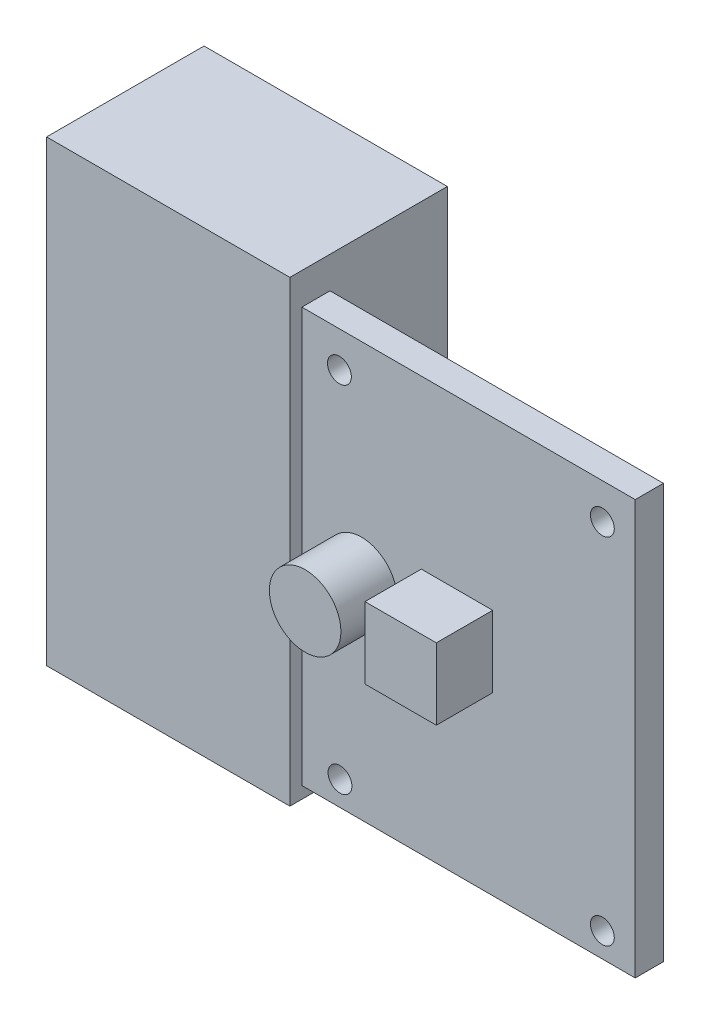
ISO-10303-21;
HEADER;
FILE_DESCRIPTION(('STEP AP214'),'2;1');
FILE_NAME('part.step','',(''),(''),'','','');
FILE_SCHEMA(('AUTOMOTIVE_DESIGN { 1 0 10303 214 1 1 1 1 }'));
ENDSEC;
DATA;
#1=APPLICATION_CONTEXT('core data for automotive mechanical design processes');
#2=APPLICATION_PROTOCOL_DEFINITION('international standard','automotive_design',2000,#1);
#3=PRODUCT_CONTEXT('',#1,'mechanical');
#4=PRODUCT('Part','Part','',(#3));
#5=PRODUCT_RELATED_PRODUCT_CATEGORY('part','',(#4));
#6=PRODUCT_DEFINITION_FORMATION('','',#4);
#7=PRODUCT_DEFINITION_CONTEXT('part definition',#1,'design');
#8=PRODUCT_DEFINITION('design','',#6,#7);
#9=PRODUCT_DEFINITION_SHAPE('','',#8);
#10=(LENGTH_UNIT() NAMED_UNIT(*) SI_UNIT(.MILLI.,.METRE.));
#11=(NAMED_UNIT(*) PLANE_ANGLE_UNIT() SI_UNIT($,.RADIAN.));
#12=(NAMED_UNIT(*) SI_UNIT($,.STERADIAN.) SOLID_ANGLE_UNIT());
#13=UNCERTAINTY_MEASURE_WITH_UNIT(LENGTH_MEASURE(1.E-05),#10,'distance_accuracy_value','');
#14=(GEOMETRIC_REPRESENTATION_CONTEXT(3) GLOBAL_UNCERTAINTY_ASSIGNED_CONTEXT((#13)) GLOBAL_UNIT_ASSIGNED_CONTEXT((#10,
#11,#12)) REPRESENTATION_CONTEXT('',''));
#15=CARTESIAN_POINT('',(0.,0.,0.));
#16=DIRECTION('',(0.,0.,1.));
#17=DIRECTION('',(1.,0.,0.));
#18=AXIS2_PLACEMENT_3D('',#15,#16,#17);
#19=CARTESIAN_POINT('',(-29.15,22.276,9.));
#20=DIRECTION('',(0.,0.,-1.));
#21=DIRECTION('',(-1.,0.,0.));
#22=AXIS2_PLACEMENT_3D('',#19,#20,#21);
#23=CYLINDRICAL_SURFACE('',#22,3.81);
#24=CARTESIAN_POINT('',(-29.15,22.276,9.));
#25=DIRECTION('',(0.,0.,1.));
#26=DIRECTION('',(1.,0.,0.));
#27=AXIS2_PLACEMENT_3D('',#24,#25,#26);
#28=CIRCLE('',#27,3.81);
#29=CARTESIAN_POINT('',(-25.34,22.276,9.));
#30=VERTEX_POINT('',#29);
#31=EDGE_CURVE('E11',#30,#30,#28,.T.);
#32=ORIENTED_EDGE('',*,*,#31,.F.);
#33=EDGE_LOOP('',(#32));
#34=FACE_BOUND('',#33,.T.);
#35=CARTESIAN_POINT('',(-29.15,22.276,3.));
#36=DIRECTION('',(0.,0.,1.));
#37=DIRECTION('',(1.,0.,0.));
#38=AXIS2_PLACEMENT_3D('',#35,#36,#37);
#39=CIRCLE('',#38,3.81);
#40=CARTESIAN_POINT('',(-25.34,22.276,3.));
#41=VERTEX_POINT('',#40);
#42=EDGE_CURVE('E49',#41,#41,#39,.T.);
#43=ORIENTED_EDGE('',*,*,#42,.T.);
#44=EDGE_LOOP('',(#43));
#45=FACE_BOUND('',#44,.T.);
#46=ADVANCED_FACE('F46',(#34,#45),#23,.T.);
#47=CARTESIAN_POINT('',(-29.15,22.276,9.));
#48=DIRECTION('',(0.,0.,1.));
#49=DIRECTION('',(1.,0.,0.));
#50=AXIS2_PLACEMENT_3D('',#47,#48,#49);
#51=PLANE('',#50);
#52=ORIENTED_EDGE('',*,*,#31,.T.);
#53=EDGE_LOOP('',(#52));
#54=FACE_BOUND('',#53,.T.);
#55=ADVANCED_FACE('F61',(#54),#51,.T.);
#56=CARTESIAN_POINT('',(-29.15,22.276,3.));
#57=DIRECTION('',(0.,0.,1.));
#58=DIRECTION('',(1.,0.,0.));
#59=AXIS2_PLACEMENT_3D('',#56,#57,#58);
#60=PLANE('',#59);
#61=ORIENTED_EDGE('',*,*,#42,.F.);
#62=EDGE_LOOP('',(#61));
#63=FACE_BOUND('',#62,.T.);
#64=ADVANCED_FACE('F59',(#63),#60,.F.);
#65=CLOSED_SHELL('',(#46,#55,#64));
#66=MANIFOLD_SOLID_BREP('B2',#65);
#67=CARTESIAN_POINT('',(-15.18,18.72,9.));
#68=DIRECTION('',(-1.,0.,0.));
#69=DIRECTION('',(0.,0.,1.));
#70=AXIS2_PLACEMENT_3D('',#67,#68,#69);
#71=PLANE('',#70);
#72=DIRECTION('',(0.,1.,0.));
#73=VECTOR('',#72,1.);
#74=CARTESIAN_POINT('',(-15.18,18.72,3.));
#75=LINE('',#74,#73);
#76=CARTESIAN_POINT('',(-15.18,18.72,3.));
#77=VERTEX_POINT('',#76);
#78=CARTESIAN_POINT('',(-15.18,26.32,3.));
#79=VERTEX_POINT('',#78);
#80=EDGE_CURVE('E160',#77,#79,#75,.T.);
#81=ORIENTED_EDGE('',*,*,#80,.T.);
#82=DIRECTION('',(0.,0.,-1.));
#83=VECTOR('',#82,1.);
#84=CARTESIAN_POINT('',(-15.18,26.32,9.));
#85=LINE('',#84,#83);
#86=CARTESIAN_POINT('',(-15.18,26.32,9.));
#87=VERTEX_POINT('',#86);
#88=EDGE_CURVE('E44',#87,#79,#85,.T.);
#89=ORIENTED_EDGE('',*,*,#88,.F.);
#90=DIRECTION('',(0.,1.,0.));
#91=VECTOR('',#90,1.);
#92=CARTESIAN_POINT('',(-15.18,18.72,9.));
#93=LINE('',#92,#91);
#94=CARTESIAN_POINT('',(-15.18,18.72,9.));
#95=VERTEX_POINT('',#94);
#96=EDGE_CURVE('E148',#95,#87,#93,.T.);
#97=ORIENTED_EDGE('',*,*,#96,.F.);
#98=DIRECTION('',(0.,0.,-1.));
#99=VECTOR('',#98,1.);
#100=CARTESIAN_POINT('',(-15.18,18.72,9.));
#101=LINE('',#100,#99);
#102=EDGE_CURVE('E156',#95,#77,#101,.T.);
#103=ORIENTED_EDGE('',*,*,#102,.T.);
#104=EDGE_LOOP('',(#81,#89,#97,#103));
#105=FACE_BOUND('',#104,.T.);
#106=ADVANCED_FACE('F97',(#105),#71,.F.);
#107=CARTESIAN_POINT('',(-15.18,26.32,9.));
#108=DIRECTION('',(0.,-1.,0.));
#109=DIRECTION('',(0.,0.,-1.));
#110=AXIS2_PLACEMENT_3D('',#107,#108,#109);
#111=PLANE('',#110);
#112=DIRECTION('',(-1.,0.,0.));
#113=VECTOR('',#112,1.);
#114=CARTESIAN_POINT('',(-15.18,26.32,3.));
#115=LINE('',#114,#113);
#116=CARTESIAN_POINT('',(-22.78,26.32,3.));
#117=VERTEX_POINT('',#116);
#118=EDGE_CURVE('E152',#79,#117,#115,.T.);
#119=ORIENTED_EDGE('',*,*,#118,.T.);
#120=DIRECTION('',(0.,0.,-1.));
#121=VECTOR('',#120,1.);
#122=CARTESIAN_POINT('',(-22.78,26.32,9.));
#123=LINE('',#122,#121);
#124=CARTESIAN_POINT('',(-22.78,26.32,9.));
#125=VERTEX_POINT('',#124);
#126=EDGE_CURVE('E105',#125,#117,#123,.T.);
#127=ORIENTED_EDGE('',*,*,#126,.F.);
#128=DIRECTION('',(-1.,0.,0.));
#129=VECTOR('',#128,1.);
#130=CARTESIAN_POINT('',(-15.18,26.32,9.));
#131=LINE('',#130,#129);
#132=EDGE_CURVE('E143',#87,#125,#131,.T.);
#133=ORIENTED_EDGE('',*,*,#132,.F.);
#134=ORIENTED_EDGE('',*,*,#88,.T.);
#135=EDGE_LOOP('',(#119,#127,#133,#134));
#136=FACE_BOUND('',#135,.T.);
#137=ADVANCED_FACE('F151',(#136),#111,.F.);
#138=CARTESIAN_POINT('',(-22.78,18.72,9.));
#139=DIRECTION('',(1.,0.,0.));
#140=DIRECTION('',(0.,0.,-1.));
#141=AXIS2_PLACEMENT_3D('',#138,#139,#140);
#142=PLANE('',#141);
#143=DIRECTION('',(0.,-1.,0.));
#144=VECTOR('',#143,1.);
#145=CARTESIAN_POINT('',(-22.78,18.72,3.));
#146=LINE('',#145,#144);
#147=CARTESIAN_POINT('',(-22.78,18.72,3.));
#148=VERTEX_POINT('',#147);
#149=EDGE_CURVE('E130',#117,#148,#146,.T.);
#150=ORIENTED_EDGE('',*,*,#149,.T.);
#151=DIRECTION('',(0.,0.,-1.));
#152=VECTOR('',#151,1.);
#153=CARTESIAN_POINT('',(-22.78,18.72,9.));
#154=LINE('',#153,#152);
#155=CARTESIAN_POINT('',(-22.78,18.72,9.));
#156=VERTEX_POINT('',#155);
#157=EDGE_CURVE('E153',#156,#148,#154,.T.);
#158=ORIENTED_EDGE('',*,*,#157,.F.);
#159=DIRECTION('',(0.,-1.,0.));
#160=VECTOR('',#159,1.);
#161=CARTESIAN_POINT('',(-22.78,18.72,9.));
#162=LINE('',#161,#160);
#163=EDGE_CURVE('E146',#125,#156,#162,.T.);
#164=ORIENTED_EDGE('',*,*,#163,.F.);
#165=ORIENTED_EDGE('',*,*,#126,.T.);
#166=EDGE_LOOP('',(#150,#158,#164,#165));
#167=FACE_BOUND('',#166,.T.);
#168=ADVANCED_FACE('F154',(#167),#142,.F.);
#169=CARTESIAN_POINT('',(-15.18,18.72,9.));
#170=DIRECTION('',(0.,1.,0.));
#171=DIRECTION('',(0.,0.,1.));
#172=AXIS2_PLACEMENT_3D('',#169,#170,#171);
#173=PLANE('',#172);
#174=DIRECTION('',(1.,0.,0.));
#175=VECTOR('',#174,1.);
#176=CARTESIAN_POINT('',(-15.18,18.72,3.));
#177=LINE('',#176,#175);
#178=EDGE_CURVE('E136',#148,#77,#177,.T.);
#179=ORIENTED_EDGE('',*,*,#178,.T.);
#180=ORIENTED_EDGE('',*,*,#102,.F.);
#181=DIRECTION('',(1.,0.,0.));
#182=VECTOR('',#181,1.);
#183=CARTESIAN_POINT('',(-15.18,18.72,9.));
#184=LINE('',#183,#182);
#185=EDGE_CURVE('E113',#156,#95,#184,.T.);
#186=ORIENTED_EDGE('',*,*,#185,.F.);
#187=ORIENTED_EDGE('',*,*,#157,.T.);
#188=EDGE_LOOP('',(#179,#180,#186,#187));
#189=FACE_BOUND('',#188,.T.);
#190=ADVANCED_FACE('F167',(#189),#173,.F.);
#191=CARTESIAN_POINT('',(0.,0.,9.));
#192=DIRECTION('',(0.,0.,1.));
#193=DIRECTION('',(1.,0.,0.));
#194=AXIS2_PLACEMENT_3D('',#191,#192,#193);
#195=PLANE('',#194);
#196=ORIENTED_EDGE('',*,*,#96,.T.);
#197=ORIENTED_EDGE('',*,*,#132,.T.);
#198=ORIENTED_EDGE('',*,*,#163,.T.);
#199=ORIENTED_EDGE('',*,*,#185,.T.);
#200=EDGE_LOOP('',(#196,#197,#198,#199));
#201=FACE_BOUND('',#200,.T.);
#202=ADVANCED_FACE('F144',(#201),#195,.T.);
#203=CARTESIAN_POINT('',(0.,0.,3.));
#204=DIRECTION('',(0.,0.,1.));
#205=DIRECTION('',(1.,0.,0.));
#206=AXIS2_PLACEMENT_3D('',#203,#204,#205);
#207=PLANE('',#206);
#208=ORIENTED_EDGE('',*,*,#80,.F.);
#209=ORIENTED_EDGE('',*,*,#178,.F.);
#210=ORIENTED_EDGE('',*,*,#149,.F.);
#211=ORIENTED_EDGE('',*,*,#118,.F.);
#212=EDGE_LOOP('',(#208,#209,#210,#211));
#213=FACE_BOUND('',#212,.T.);
#214=ADVANCED_FACE('F170',(#213),#207,.F.);
#215=CLOSED_SHELL('',(#106,#137,#168,#190,#202,#214));
#216=MANIFOLD_SOLID_BREP('B6',#215);
#217=CARTESIAN_POINT('',(-62.678,46.228,-13.764));
#218=DIRECTION('',(-1.,0.,0.));
#219=DIRECTION('',(0.,0.,1.));
#220=AXIS2_PLACEMENT_3D('',#217,#218,#219);
#221=PLANE('',#220);
#222=DIRECTION('',(0.,0.,1.));
#223=VECTOR('',#222,1.);
#224=CARTESIAN_POINT('',(-62.678,-2.54000000000001,-13.764));
#225=LINE('',#224,#223);
#226=CARTESIAN_POINT('',(-62.678,-2.54000000000001,-13.764));
#227=VERTEX_POINT('',#226);
#228=CARTESIAN_POINT('',(-62.678,-2.54000000000001,3.00254));
#229=VERTEX_POINT('',#228);
#230=EDGE_CURVE('E233',#227,#229,#225,.T.);
#231=ORIENTED_EDGE('',*,*,#230,.T.);
#232=DIRECTION('',(0.,-1.,0.));
#233=VECTOR('',#232,1.);
#234=CARTESIAN_POINT('',(-62.678,46.228,3.00254));
#235=LINE('',#234,#233);
#236=CARTESIAN_POINT('',(-62.678,46.228,3.00254));
#237=VERTEX_POINT('',#236);
#238=EDGE_CURVE('E270',#237,#229,#235,.T.);
#239=ORIENTED_EDGE('',*,*,#238,.F.);
#240=DIRECTION('',(0.,0.,1.));
#241=VECTOR('',#240,1.);
#242=CARTESIAN_POINT('',(-62.678,46.228,-13.764));
#243=LINE('',#242,#241);
#244=CARTESIAN_POINT('',(-62.678,46.228,-13.764));
#245=VERTEX_POINT('',#244);
#246=EDGE_CURVE('E95',#245,#237,#243,.T.);
#247=ORIENTED_EDGE('',*,*,#246,.F.);
#248=DIRECTION('',(0.,-1.,0.));
#249=VECTOR('',#248,1.);
#250=CARTESIAN_POINT('',(-62.678,46.228,-13.764));
#251=LINE('',#250,#249);
#252=EDGE_CURVE('E271',#245,#227,#251,.T.);
#253=ORIENTED_EDGE('',*,*,#252,.T.);
#254=EDGE_LOOP('',(#231,#239,#247,#253));
#255=FACE_BOUND('',#254,.T.);
#256=ADVANCED_FACE('F230',(#255),#221,.T.);
#257=CARTESIAN_POINT('',(-62.678,46.228,-13.764));
#258=DIRECTION('',(0.,1.,0.));
#259=DIRECTION('',(0.,0.,1.));
#260=AXIS2_PLACEMENT_3D('',#257,#258,#259);
#261=PLANE('',#260);
#262=ORIENTED_EDGE('',*,*,#246,.T.);
#263=DIRECTION('',(-1.,0.,0.));
#264=VECTOR('',#263,1.);
#265=CARTESIAN_POINT('',(-62.678,46.228,3.00254));
#266=LINE('',#265,#264);
#267=CARTESIAN_POINT('',(-36.77,46.228,3.00254));
#268=VERTEX_POINT('',#267);
#269=EDGE_CURVE('E287',#268,#237,#266,.T.);
#270=ORIENTED_EDGE('',*,*,#269,.F.);
#271=DIRECTION('',(0.,0.,1.));
#272=VECTOR('',#271,1.);
#273=CARTESIAN_POINT('',(-36.77,46.228,-13.764));
#274=LINE('',#273,#272);
#275=CARTESIAN_POINT('',(-36.77,46.228,-13.764));
#276=VERTEX_POINT('',#275);
#277=EDGE_CURVE('E238',#276,#268,#274,.T.);
#278=ORIENTED_EDGE('',*,*,#277,.F.);
#279=DIRECTION('',(-1.,0.,0.));
#280=VECTOR('',#279,1.);
#281=CARTESIAN_POINT('',(-62.678,46.228,-13.764));
#282=LINE('',#281,#280);
#283=EDGE_CURVE('E276',#276,#245,#282,.T.);
#284=ORIENTED_EDGE('',*,*,#283,.T.);
#285=EDGE_LOOP('',(#262,#270,#278,#284));
#286=FACE_BOUND('',#285,.T.);
#287=ADVANCED_FACE('F302',(#286),#261,.T.);
#288=CARTESIAN_POINT('',(-36.77,46.228,-13.764));
#289=DIRECTION('',(1.,0.,0.));
#290=DIRECTION('',(0.,1.,0.));
#291=AXIS2_PLACEMENT_3D('',#288,#289,#290);
#292=PLANE('',#291);
#293=ORIENTED_EDGE('',*,*,#277,.T.);
#294=DIRECTION('',(0.,1.,0.));
#295=VECTOR('',#294,1.);
#296=CARTESIAN_POINT('',(-36.77,46.228,3.00254));
#297=LINE('',#296,#295);
#298=CARTESIAN_POINT('',(-36.77,-2.54000000000001,3.00254));
#299=VERTEX_POINT('',#298);
#300=EDGE_CURVE('E283',#299,#268,#297,.T.);
#301=ORIENTED_EDGE('',*,*,#300,.F.);
#302=DIRECTION('',(0.,0.,1.));
#303=VECTOR('',#302,1.);
#304=CARTESIAN_POINT('',(-36.77,-2.54000000000001,-13.764));
#305=LINE('',#304,#303);
#306=CARTESIAN_POINT('',(-36.77,-2.54000000000001,-13.764));
#307=VERTEX_POINT('',#306);
#308=EDGE_CURVE('E275',#307,#299,#305,.T.);
#309=ORIENTED_EDGE('',*,*,#308,.F.);
#310=DIRECTION('',(0.,1.,0.));
#311=VECTOR('',#310,1.);
#312=CARTESIAN_POINT('',(-36.77,46.228,-13.764));
#313=LINE('',#312,#311);
#314=EDGE_CURVE('E295',#307,#276,#313,.T.);
#315=ORIENTED_EDGE('',*,*,#314,.T.);
#316=EDGE_LOOP('',(#293,#301,#309,#315));
#317=FACE_BOUND('',#316,.T.);
#318=ADVANCED_FACE('F299',(#317),#292,.T.);
#319=CARTESIAN_POINT('',(-62.678,-2.54000000000001,-13.764));
#320=DIRECTION('',(0.,-1.,0.));
#321=DIRECTION('',(1.,0.,0.));
#322=AXIS2_PLACEMENT_3D('',#319,#320,#321);
#323=PLANE('',#322);
#324=ORIENTED_EDGE('',*,*,#308,.T.);
#325=DIRECTION('',(1.,0.,0.));
#326=VECTOR('',#325,1.);
#327=CARTESIAN_POINT('',(-62.678,-2.54000000000001,3.00254));
#328=LINE('',#327,#326);
#329=EDGE_CURVE('E278',#229,#299,#328,.T.);
#330=ORIENTED_EDGE('',*,*,#329,.F.);
#331=ORIENTED_EDGE('',*,*,#230,.F.);
#332=DIRECTION('',(1.,0.,0.));
#333=VECTOR('',#332,1.);
#334=CARTESIAN_POINT('',(-62.678,-2.54000000000001,-13.764));
#335=LINE('',#334,#333);
#336=EDGE_CURVE('E293',#227,#307,#335,.T.);
#337=ORIENTED_EDGE('',*,*,#336,.T.);
#338=EDGE_LOOP('',(#324,#330,#331,#337));
#339=FACE_BOUND('',#338,.T.);
#340=ADVANCED_FACE('F279',(#339),#323,.T.);
#341=CARTESIAN_POINT('',(0.,0.,-13.764));
#342=DIRECTION('',(0.,0.,1.));
#343=DIRECTION('',(1.,0.,0.));
#344=AXIS2_PLACEMENT_3D('',#341,#342,#343);
#345=PLANE('',#344);
#346=ORIENTED_EDGE('',*,*,#252,.F.);
#347=ORIENTED_EDGE('',*,*,#283,.F.);
#348=ORIENTED_EDGE('',*,*,#314,.F.);
#349=ORIENTED_EDGE('',*,*,#336,.F.);
#350=EDGE_LOOP('',(#346,#347,#348,#349));
#351=FACE_BOUND('',#350,.T.);
#352=ADVANCED_FACE('F304',(#351),#345,.F.);
#353=CARTESIAN_POINT('',(0.,0.,3.00254));
#354=DIRECTION('',(0.,0.,1.));
#355=DIRECTION('',(1.,0.,0.));
#356=AXIS2_PLACEMENT_3D('',#353,#354,#355);
#357=PLANE('',#356);
#358=ORIENTED_EDGE('',*,*,#238,.T.);
#359=ORIENTED_EDGE('',*,*,#329,.T.);
#360=ORIENTED_EDGE('',*,*,#300,.T.);
#361=ORIENTED_EDGE('',*,*,#269,.T.);
#362=EDGE_LOOP('',(#358,#359,#360,#361));
#363=FACE_BOUND('',#362,.T.);
#364=ADVANCED_FACE('F286',(#363),#357,.T.);
#365=CLOSED_SHELL('',(#256,#287,#318,#340,#352,#364));
#366=MANIFOLD_SOLID_BREP('B38',#365);
#367=CARTESIAN_POINT('',(0.,0.,3.));
#368=DIRECTION('',(0.,0.,1.));
#369=DIRECTION('',(1.,0.,0.));
#370=AXIS2_PLACEMENT_3D('',#367,#368,#369);
#371=PLANE('',#370);
#372=CARTESIAN_POINT('',(-3.5,40.32,3.));
#373=DIRECTION('',(0.,0.,1.));
#374=DIRECTION('',(1.,0.,0.));
#375=AXIS2_PLACEMENT_3D('',#372,#373,#374);
#376=CIRCLE('',#375,1.27);
#377=CARTESIAN_POINT('',(-2.23,40.32,3.));
#378=VERTEX_POINT('',#377);
#379=EDGE_CURVE('E581',#378,#378,#376,.T.);
#380=ORIENTED_EDGE('',*,*,#379,.F.);
#381=EDGE_LOOP('',(#380));
#382=FACE_BOUND('',#381,.T.);
#383=CARTESIAN_POINT('',(-31.44,2.59999999999999,3.));
#384=DIRECTION('',(0.,0.,1.));
#385=DIRECTION('',(1.,0.,0.));
#386=AXIS2_PLACEMENT_3D('',#383,#384,#385);
#387=CIRCLE('',#386,1.27);
#388=CARTESIAN_POINT('',(-30.17,2.59999999999999,3.));
#389=VERTEX_POINT('',#388);
#390=EDGE_CURVE('E448',#389,#389,#387,.T.);
#391=ORIENTED_EDGE('',*,*,#390,.F.);
#392=EDGE_LOOP('',(#391));
#393=FACE_BOUND('',#392,.T.);
#394=DIRECTION('',(0.,1.,0.));
#395=VECTOR('',#394,1.);
#396=CARTESIAN_POINT('',(0.,0.,3.));
#397=LINE('',#396,#395);
#398=CARTESIAN_POINT('',(0.,0.,3.));
#399=VERTEX_POINT('',#398);
#400=CARTESIAN_POINT('',(0.,44.12,3.));
#401=VERTEX_POINT('',#400);
#402=EDGE_CURVE('E464',#399,#401,#397,.T.);
#403=ORIENTED_EDGE('',*,*,#402,.T.);
#404=DIRECTION('',(-1.,0.,0.));
#405=VECTOR('',#404,1.);
#406=CARTESIAN_POINT('',(0.,44.12,3.));
#407=LINE('',#406,#405);
#408=CARTESIAN_POINT('',(-35.5,44.12,3.));
#409=VERTEX_POINT('',#408);
#410=EDGE_CURVE('E467',#401,#409,#407,.T.);
#411=ORIENTED_EDGE('',*,*,#410,.T.);
#412=DIRECTION('',(0.,-1.,0.));
#413=VECTOR('',#412,1.);
#414=CARTESIAN_POINT('',(-35.5,0.,3.));
#415=LINE('',#414,#413);
#416=CARTESIAN_POINT('',(-35.5,0.,3.));
#417=VERTEX_POINT('',#416);
#418=EDGE_CURVE('E470',#409,#417,#415,.T.);
#419=ORIENTED_EDGE('',*,*,#418,.T.);
#420=DIRECTION('',(1.,0.,0.));
#421=VECTOR('',#420,1.);
#422=CARTESIAN_POINT('',(0.,0.,3.));
#423=LINE('',#422,#421);
#424=EDGE_CURVE('E472',#417,#399,#423,.T.);
#425=ORIENTED_EDGE('',*,*,#424,.T.);
#426=EDGE_LOOP('',(#403,#411,#419,#425));
#427=FACE_BOUND('',#426,.T.);
#428=CARTESIAN_POINT('',(-29.15,22.276,3.));
#429=DIRECTION('',(0.,0.,1.));
#430=DIRECTION('',(1.,0.,0.));
#431=AXIS2_PLACEMENT_3D('',#428,#429,#430);
#432=CIRCLE('',#431,3.81);
#433=CARTESIAN_POINT('',(-25.34,22.276,3.));
#434=VERTEX_POINT('',#433);
#435=EDGE_CURVE('E458',#434,#434,#432,.T.);
#436=ORIENTED_EDGE('',*,*,#435,.F.);
#437=EDGE_LOOP('',(#436));
#438=FACE_BOUND('',#437,.T.);
#439=DIRECTION('',(1.,0.,0.));
#440=VECTOR('',#439,1.);
#441=CARTESIAN_POINT('',(-22.78,18.72,3.));
#442=LINE('',#441,#440);
#443=CARTESIAN_POINT('',(-22.78,18.72,3.));
#444=VERTEX_POINT('',#443);
#445=CARTESIAN_POINT('',(-15.18,18.72,3.));
#446=VERTEX_POINT('',#445);
#447=EDGE_CURVE('E427',#444,#446,#442,.T.);
#448=ORIENTED_EDGE('',*,*,#447,.F.);
#449=DIRECTION('',(0.,-1.,0.));
#450=VECTOR('',#449,1.);
#451=CARTESIAN_POINT('',(-22.78,26.32,3.));
#452=LINE('',#451,#450);
#453=CARTESIAN_POINT('',(-22.78,26.32,3.));
#454=VERTEX_POINT('',#453);
#455=EDGE_CURVE('E419',#454,#444,#452,.T.);
#456=ORIENTED_EDGE('',*,*,#455,.F.);
#457=DIRECTION('',(-1.,0.,0.));
#458=VECTOR('',#457,1.);
#459=CARTESIAN_POINT('',(-22.78,26.32,3.));
#460=LINE('',#459,#458);
#461=CARTESIAN_POINT('',(-15.18,26.32,3.));
#462=VERTEX_POINT('',#461);
#463=EDGE_CURVE('E442',#462,#454,#460,.T.);
#464=ORIENTED_EDGE('',*,*,#463,.F.);
#465=DIRECTION('',(0.,1.,0.));
#466=VECTOR('',#465,1.);
#467=CARTESIAN_POINT('',(-15.18,26.32,3.));
#468=LINE('',#467,#466);
#469=EDGE_CURVE('E440',#446,#462,#468,.T.);
#470=ORIENTED_EDGE('',*,*,#469,.F.);
#471=EDGE_LOOP('',(#448,#456,#464,#470));
#472=FACE_BOUND('',#471,.T.);
#473=CARTESIAN_POINT('',(-3.5,2.59999999999999,3.));
#474=DIRECTION('',(0.,0.,1.));
#475=DIRECTION('',(1.,0.,0.));
#476=AXIS2_PLACEMENT_3D('',#473,#474,#475);
#477=CIRCLE('',#476,1.27);
#478=CARTESIAN_POINT('',(-2.23,2.59999999999999,3.));
#479=VERTEX_POINT('',#478);
#480=EDGE_CURVE('E587',#479,#479,#477,.T.);
#481=ORIENTED_EDGE('',*,*,#480,.F.);
#482=EDGE_LOOP('',(#481));
#483=FACE_BOUND('',#482,.T.);
#484=CARTESIAN_POINT('',(-31.5,40.32,3.));
#485=DIRECTION('',(0.,0.,1.));
#486=DIRECTION('',(1.,0.,0.));
#487=AXIS2_PLACEMENT_3D('',#484,#485,#486);
#488=CIRCLE('',#487,1.27);
#489=CARTESIAN_POINT('',(-30.23,40.32,3.));
#490=VERTEX_POINT('',#489);
#491=EDGE_CURVE('E572',#490,#490,#488,.T.);
#492=ORIENTED_EDGE('',*,*,#491,.F.);
#493=EDGE_LOOP('',(#492));
#494=FACE_BOUND('',#493,.T.);
#495=ADVANCED_FACE('F354',(#382,#393,#427,#438,#472,#483,#494),#371,.T.);
#496=CARTESIAN_POINT('',(0.,0.,0.));
#497=DIRECTION('',(0.,0.,1.));
#498=DIRECTION('',(1.,0.,0.));
#499=AXIS2_PLACEMENT_3D('',#496,#497,#498);
#500=PLANE('',#499);
#501=CARTESIAN_POINT('',(-29.15,22.276,0.));
#502=DIRECTION('',(0.,0.,1.));
#503=DIRECTION('',(1.,0.,0.));
#504=AXIS2_PLACEMENT_3D('',#501,#502,#503);
#505=CIRCLE('',#504,3.81);
#506=CARTESIAN_POINT('',(-25.34,22.276,0.));
#507=VERTEX_POINT('',#506);
#508=EDGE_CURVE('E435',#507,#507,#505,.T.);
#509=ORIENTED_EDGE('',*,*,#508,.T.);
#510=EDGE_LOOP('',(#509));
#511=FACE_BOUND('',#510,.T.);
#512=DIRECTION('',(0.,1.,0.));
#513=VECTOR('',#512,1.);
#514=CARTESIAN_POINT('',(0.,0.,0.));
#515=LINE('',#514,#513);
#516=CARTESIAN_POINT('',(0.,0.,0.));
#517=VERTEX_POINT('',#516);
#518=CARTESIAN_POINT('',(0.,44.12,0.));
#519=VERTEX_POINT('',#518);
#520=EDGE_CURVE('E461',#517,#519,#515,.T.);
#521=ORIENTED_EDGE('',*,*,#520,.F.);
#522=DIRECTION('',(1.,0.,0.));
#523=VECTOR('',#522,1.);
#524=CARTESIAN_POINT('',(0.,0.,0.));
#525=LINE('',#524,#523);
#526=CARTESIAN_POINT('',(-35.5,0.,0.));
#527=VERTEX_POINT('',#526);
#528=EDGE_CURVE('E468',#527,#517,#525,.T.);
#529=ORIENTED_EDGE('',*,*,#528,.F.);
#530=DIRECTION('',(0.,-1.,0.));
#531=VECTOR('',#530,1.);
#532=CARTESIAN_POINT('',(-35.5,0.,0.));
#533=LINE('',#532,#531);
#534=CARTESIAN_POINT('',(-35.5,44.12,0.));
#535=VERTEX_POINT('',#534);
#536=EDGE_CURVE('E479',#535,#527,#533,.T.);
#537=ORIENTED_EDGE('',*,*,#536,.F.);
#538=DIRECTION('',(-1.,0.,0.));
#539=VECTOR('',#538,1.);
#540=CARTESIAN_POINT('',(0.,44.12,0.));
#541=LINE('',#540,#539);
#542=EDGE_CURVE('E477',#519,#535,#541,.T.);
#543=ORIENTED_EDGE('',*,*,#542,.F.);
#544=EDGE_LOOP('',(#521,#529,#537,#543));
#545=FACE_BOUND('',#544,.T.);
#546=DIRECTION('',(0.,-1.,0.));
#547=VECTOR('',#546,1.);
#548=CARTESIAN_POINT('',(-22.78,26.32,0.));
#549=LINE('',#548,#547);
#550=CARTESIAN_POINT('',(-22.78,26.32,0.));
#551=VERTEX_POINT('',#550);
#552=CARTESIAN_POINT('',(-22.78,18.72,0.));
#553=VERTEX_POINT('',#552);
#554=EDGE_CURVE('E377',#551,#553,#549,.T.);
#555=ORIENTED_EDGE('',*,*,#554,.T.);
#556=DIRECTION('',(1.,0.,0.));
#557=VECTOR('',#556,1.);
#558=CARTESIAN_POINT('',(-22.78,18.72,0.));
#559=LINE('',#558,#557);
#560=CARTESIAN_POINT('',(-15.18,18.72,0.));
#561=VERTEX_POINT('',#560);
#562=EDGE_CURVE('E434',#553,#561,#559,.T.);
#563=ORIENTED_EDGE('',*,*,#562,.T.);
#564=DIRECTION('',(0.,1.,0.));
#565=VECTOR('',#564,1.);
#566=CARTESIAN_POINT('',(-15.18,26.32,0.));
#567=LINE('',#566,#565);
#568=CARTESIAN_POINT('',(-15.18,26.32,0.));
#569=VERTEX_POINT('',#568);
#570=EDGE_CURVE('E450',#561,#569,#567,.T.);
#571=ORIENTED_EDGE('',*,*,#570,.T.);
#572=DIRECTION('',(-1.,0.,0.));
#573=VECTOR('',#572,1.);
#574=CARTESIAN_POINT('',(-22.78,26.32,0.));
#575=LINE('',#574,#573);
#576=EDGE_CURVE('E428',#569,#551,#575,.T.);
#577=ORIENTED_EDGE('',*,*,#576,.T.);
#578=EDGE_LOOP('',(#555,#563,#571,#577));
#579=FACE_BOUND('',#578,.T.);
#580=CARTESIAN_POINT('',(-31.44,2.59999999999999,0.));
#581=DIRECTION('',(0.,0.,1.));
#582=DIRECTION('',(1.,0.,0.));
#583=AXIS2_PLACEMENT_3D('',#580,#581,#582);
#584=CIRCLE('',#583,1.27);
#585=CARTESIAN_POINT('',(-30.17,2.59999999999999,0.));
#586=VERTEX_POINT('',#585);
#587=EDGE_CURVE('E590',#586,#586,#584,.T.);
#588=ORIENTED_EDGE('',*,*,#587,.T.);
#589=EDGE_LOOP('',(#588));
#590=FACE_BOUND('',#589,.T.);
#591=CARTESIAN_POINT('',(-3.5,2.59999999999999,0.));
#592=DIRECTION('',(0.,0.,1.));
#593=DIRECTION('',(1.,0.,0.));
#594=AXIS2_PLACEMENT_3D('',#591,#592,#593);
#595=CIRCLE('',#594,1.27);
#596=CARTESIAN_POINT('',(-2.23,2.59999999999999,0.));
#597=VERTEX_POINT('',#596);
#598=EDGE_CURVE('E584',#597,#597,#595,.T.);
#599=ORIENTED_EDGE('',*,*,#598,.T.);
#600=EDGE_LOOP('',(#599));
#601=FACE_BOUND('',#600,.T.);
#602=CARTESIAN_POINT('',(-3.5,40.32,0.));
#603=DIRECTION('',(0.,0.,1.));
#604=DIRECTION('',(1.,0.,0.));
#605=AXIS2_PLACEMENT_3D('',#602,#603,#604);
#606=CIRCLE('',#605,1.27);
#607=CARTESIAN_POINT('',(-2.23,40.32,0.));
#608=VERTEX_POINT('',#607);
#609=EDGE_CURVE('E578',#608,#608,#606,.T.);
#610=ORIENTED_EDGE('',*,*,#609,.T.);
#611=EDGE_LOOP('',(#610));
#612=FACE_BOUND('',#611,.T.);
#613=CARTESIAN_POINT('',(-31.5,40.32,0.));
#614=DIRECTION('',(0.,0.,1.));
#615=DIRECTION('',(1.,0.,0.));
#616=AXIS2_PLACEMENT_3D('',#613,#614,#615);
#617=CIRCLE('',#616,1.27);
#618=CARTESIAN_POINT('',(-30.23,40.32,0.));
#619=VERTEX_POINT('',#618);
#620=EDGE_CURVE('E575',#619,#619,#617,.T.);
#621=ORIENTED_EDGE('',*,*,#620,.T.);
#622=EDGE_LOOP('',(#621));
#623=FACE_BOUND('',#622,.T.);
#624=ADVANCED_FACE('F497',(#511,#545,#579,#590,#601,#612,#623),#500,.F.);
#625=CARTESIAN_POINT('',(0.,0.,3.));
#626=DIRECTION('',(-1.,0.,0.));
#627=DIRECTION('',(0.,0.,1.));
#628=AXIS2_PLACEMENT_3D('',#625,#626,#627);
#629=PLANE('',#628);
#630=ORIENTED_EDGE('',*,*,#520,.T.);
#631=DIRECTION('',(0.,0.,-1.));
#632=VECTOR('',#631,1.);
#633=CARTESIAN_POINT('',(0.,44.12,3.));
#634=LINE('',#633,#632);
#635=EDGE_CURVE('E228',#401,#519,#634,.T.);
#636=ORIENTED_EDGE('',*,*,#635,.F.);
#637=ORIENTED_EDGE('',*,*,#402,.F.);
#638=DIRECTION('',(0.,0.,-1.));
#639=VECTOR('',#638,1.);
#640=CARTESIAN_POINT('',(0.,0.,3.));
#641=LINE('',#640,#639);
#642=EDGE_CURVE('E474',#399,#517,#641,.T.);
#643=ORIENTED_EDGE('',*,*,#642,.T.);
#644=EDGE_LOOP('',(#630,#636,#637,#643));
#645=FACE_BOUND('',#644,.T.);
#646=ADVANCED_FACE('F356',(#645),#629,.F.);
#647=CARTESIAN_POINT('',(0.,44.12,3.));
#648=DIRECTION('',(0.,-1.,0.));
#649=DIRECTION('',(1.,0.,0.));
#650=AXIS2_PLACEMENT_3D('',#647,#648,#649);
#651=PLANE('',#650);
#652=ORIENTED_EDGE('',*,*,#542,.T.);
#653=DIRECTION('',(0.,0.,-1.));
#654=VECTOR('',#653,1.);
#655=CARTESIAN_POINT('',(-35.5,44.12,3.));
#656=LINE('',#655,#654);
#657=EDGE_CURVE('E362',#409,#535,#656,.T.);
#658=ORIENTED_EDGE('',*,*,#657,.F.);
#659=ORIENTED_EDGE('',*,*,#410,.F.);
#660=ORIENTED_EDGE('',*,*,#635,.T.);
#661=EDGE_LOOP('',(#652,#658,#659,#660));
#662=FACE_BOUND('',#661,.T.);
#663=ADVANCED_FACE('F508',(#662),#651,.F.);
#664=CARTESIAN_POINT('',(-35.5,0.,3.));
#665=DIRECTION('',(1.,0.,0.));
#666=DIRECTION('',(0.,0.,-1.));
#667=AXIS2_PLACEMENT_3D('',#664,#665,#666);
#668=PLANE('',#667);
#669=ORIENTED_EDGE('',*,*,#536,.T.);
#670=DIRECTION('',(0.,0.,-1.));
#671=VECTOR('',#670,1.);
#672=CARTESIAN_POINT('',(-35.5,0.,3.));
#673=LINE('',#672,#671);
#674=EDGE_CURVE('E484',#417,#527,#673,.T.);
#675=ORIENTED_EDGE('',*,*,#674,.F.);
#676=ORIENTED_EDGE('',*,*,#418,.F.);
#677=ORIENTED_EDGE('',*,*,#657,.T.);
#678=EDGE_LOOP('',(#669,#675,#676,#677));
#679=FACE_BOUND('',#678,.T.);
#680=ADVANCED_FACE('F491',(#679),#668,.F.);
#681=CARTESIAN_POINT('',(0.,0.,3.));
#682=DIRECTION('',(0.,1.,0.));
#683=DIRECTION('',(-1.,0.,0.));
#684=AXIS2_PLACEMENT_3D('',#681,#682,#683);
#685=PLANE('',#684);
#686=ORIENTED_EDGE('',*,*,#528,.T.);
#687=ORIENTED_EDGE('',*,*,#642,.F.);
#688=ORIENTED_EDGE('',*,*,#424,.F.);
#689=ORIENTED_EDGE('',*,*,#674,.T.);
#690=EDGE_LOOP('',(#686,#687,#688,#689));
#691=FACE_BOUND('',#690,.T.);
#692=ADVANCED_FACE('F501',(#691),#685,.F.);
#693=CARTESIAN_POINT('',(-29.15,22.276,3.));
#694=DIRECTION('',(0.,0.,-1.));
#695=DIRECTION('',(-1.,0.,0.));
#696=AXIS2_PLACEMENT_3D('',#693,#694,#695);
#697=CYLINDRICAL_SURFACE('',#696,3.81);
#698=ORIENTED_EDGE('',*,*,#435,.T.);
#699=EDGE_LOOP('',(#698));
#700=FACE_BOUND('',#699,.T.);
#701=ORIENTED_EDGE('',*,*,#508,.F.);
#702=EDGE_LOOP('',(#701));
#703=FACE_BOUND('',#702,.T.);
#704=ADVANCED_FACE('F526',(#700,#703),#697,.F.);
#705=CARTESIAN_POINT('',(-22.78,26.32,3.));
#706=DIRECTION('',(1.,0.,0.));
#707=DIRECTION('',(0.,0.,-1.));
#708=AXIS2_PLACEMENT_3D('',#705,#706,#707);
#709=PLANE('',#708);
#710=ORIENTED_EDGE('',*,*,#554,.F.);
#711=DIRECTION('',(0.,0.,-1.));
#712=VECTOR('',#711,1.);
#713=CARTESIAN_POINT('',(-22.78,26.32,3.));
#714=LINE('',#713,#712);
#715=EDGE_CURVE('E423',#454,#551,#714,.T.);
#716=ORIENTED_EDGE('',*,*,#715,.F.);
#717=ORIENTED_EDGE('',*,*,#455,.T.);
#718=DIRECTION('',(0.,0.,-1.));
#719=VECTOR('',#718,1.);
#720=CARTESIAN_POINT('',(-22.78,18.72,3.));
#721=LINE('',#720,#719);
#722=EDGE_CURVE('E422',#444,#553,#721,.T.);
#723=ORIENTED_EDGE('',*,*,#722,.T.);
#724=EDGE_LOOP('',(#710,#716,#717,#723));
#725=FACE_BOUND('',#724,.T.);
#726=ADVANCED_FACE('F421',(#725),#709,.T.);
#727=CARTESIAN_POINT('',(-22.78,18.72,3.));
#728=DIRECTION('',(0.,1.,0.));
#729=DIRECTION('',(0.,0.,1.));
#730=AXIS2_PLACEMENT_3D('',#727,#728,#729);
#731=PLANE('',#730);
#732=ORIENTED_EDGE('',*,*,#562,.F.);
#733=ORIENTED_EDGE('',*,*,#722,.F.);
#734=ORIENTED_EDGE('',*,*,#447,.T.);
#735=DIRECTION('',(0.,0.,-1.));
#736=VECTOR('',#735,1.);
#737=CARTESIAN_POINT('',(-15.18,18.72,3.));
#738=LINE('',#737,#736);
#739=EDGE_CURVE('E436',#446,#561,#738,.T.);
#740=ORIENTED_EDGE('',*,*,#739,.T.);
#741=EDGE_LOOP('',(#732,#733,#734,#740));
#742=FACE_BOUND('',#741,.T.);
#743=ADVANCED_FACE('F431',(#742),#731,.T.);
#744=CARTESIAN_POINT('',(-15.18,26.32,3.));
#745=DIRECTION('',(-1.,0.,0.));
#746=DIRECTION('',(0.,-1.,0.));
#747=AXIS2_PLACEMENT_3D('',#744,#745,#746);
#748=PLANE('',#747);
#749=ORIENTED_EDGE('',*,*,#570,.F.);
#750=ORIENTED_EDGE('',*,*,#739,.F.);
#751=ORIENTED_EDGE('',*,*,#469,.T.);
#752=DIRECTION('',(0.,0.,-1.));
#753=VECTOR('',#752,1.);
#754=CARTESIAN_POINT('',(-15.18,26.32,3.));
#755=LINE('',#754,#753);
#756=EDGE_CURVE('E369',#462,#569,#755,.T.);
#757=ORIENTED_EDGE('',*,*,#756,.T.);
#758=EDGE_LOOP('',(#749,#750,#751,#757));
#759=FACE_BOUND('',#758,.T.);
#760=ADVANCED_FACE('F543',(#759),#748,.T.);
#761=CARTESIAN_POINT('',(-22.78,26.32,3.));
#762=DIRECTION('',(0.,-1.,0.));
#763=DIRECTION('',(0.,0.,-1.));
#764=AXIS2_PLACEMENT_3D('',#761,#762,#763);
#765=PLANE('',#764);
#766=ORIENTED_EDGE('',*,*,#576,.F.);
#767=ORIENTED_EDGE('',*,*,#756,.F.);
#768=ORIENTED_EDGE('',*,*,#463,.T.);
#769=ORIENTED_EDGE('',*,*,#715,.T.);
#770=EDGE_LOOP('',(#766,#767,#768,#769));
#771=FACE_BOUND('',#770,.T.);
#772=ADVANCED_FACE('F548',(#771),#765,.T.);
#773=CARTESIAN_POINT('',(-31.44,2.59999999999999,3.));
#774=DIRECTION('',(0.,0.,-1.));
#775=DIRECTION('',(-1.,0.,0.));
#776=AXIS2_PLACEMENT_3D('',#773,#774,#775);
#777=CYLINDRICAL_SURFACE('',#776,1.27);
#778=ORIENTED_EDGE('',*,*,#390,.T.);
#779=EDGE_LOOP('',(#778));
#780=FACE_BOUND('',#779,.T.);
#781=ORIENTED_EDGE('',*,*,#587,.F.);
#782=EDGE_LOOP('',(#781));
#783=FACE_BOUND('',#782,.T.);
#784=ADVANCED_FACE('F552',(#780,#783),#777,.F.);
#785=CARTESIAN_POINT('',(-3.5,2.59999999999999,3.));
#786=DIRECTION('',(0.,0.,-1.));
#787=DIRECTION('',(-1.,0.,0.));
#788=AXIS2_PLACEMENT_3D('',#785,#786,#787);
#789=CYLINDRICAL_SURFACE('',#788,1.27);
#790=ORIENTED_EDGE('',*,*,#480,.T.);
#791=EDGE_LOOP('',(#790));
#792=FACE_BOUND('',#791,.T.);
#793=ORIENTED_EDGE('',*,*,#598,.F.);
#794=EDGE_LOOP('',(#793));
#795=FACE_BOUND('',#794,.T.);
#796=ADVANCED_FACE('F555',(#792,#795),#789,.F.);
#797=CARTESIAN_POINT('',(-3.5,40.32,3.));
#798=DIRECTION('',(0.,0.,-1.));
#799=DIRECTION('',(-1.,0.,0.));
#800=AXIS2_PLACEMENT_3D('',#797,#798,#799);
#801=CYLINDRICAL_SURFACE('',#800,1.27);
#802=ORIENTED_EDGE('',*,*,#379,.T.);
#803=EDGE_LOOP('',(#802));
#804=FACE_BOUND('',#803,.T.);
#805=ORIENTED_EDGE('',*,*,#609,.F.);
#806=EDGE_LOOP('',(#805));
#807=FACE_BOUND('',#806,.T.);
#808=ADVANCED_FACE('F559',(#804,#807),#801,.F.);
#809=CARTESIAN_POINT('',(-31.5,40.32,3.));
#810=DIRECTION('',(0.,0.,-1.));
#811=DIRECTION('',(-1.,0.,0.));
#812=AXIS2_PLACEMENT_3D('',#809,#810,#811);
#813=CYLINDRICAL_SURFACE('',#812,1.27);
#814=ORIENTED_EDGE('',*,*,#491,.T.);
#815=EDGE_LOOP('',(#814));
#816=FACE_BOUND('',#815,.T.);
#817=ORIENTED_EDGE('',*,*,#620,.F.);
#818=EDGE_LOOP('',(#817));
#819=FACE_BOUND('',#818,.T.);
#820=ADVANCED_FACE('F563',(#816,#819),#813,.F.);
#821=CLOSED_SHELL('',(#495,#624,#646,#663,#680,#692,#704,#726,#743,#760,#772,#784,#796,#808,#820));
#822=MANIFOLD_SOLID_BREP('B89',#821);
#823=ADVANCED_BREP_SHAPE_REPRESENTATION('',(#18,#66,#216,#366,#822),#14);
#824=SHAPE_DEFINITION_REPRESENTATION(#9,#823);
ENDSEC;
END-ISO-10303-21;
